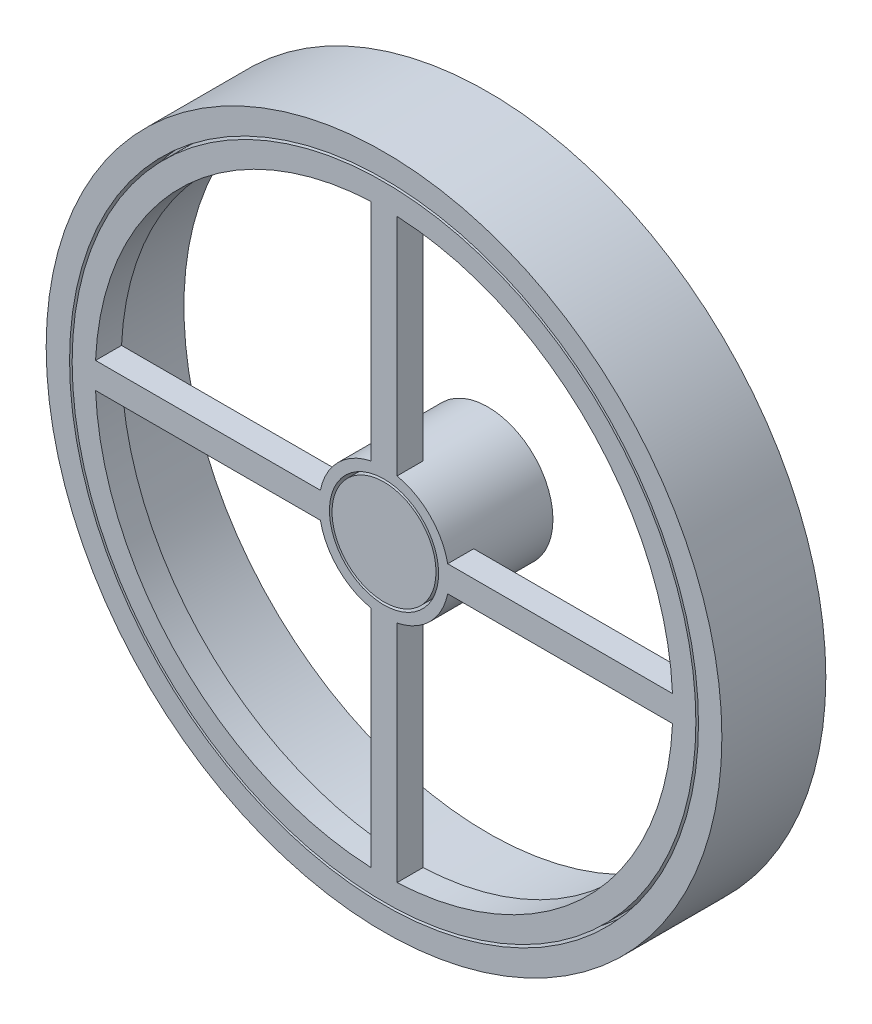
ISO-10303-21;
HEADER;
FILE_DESCRIPTION(('STEP AP214'),'2;1');
FILE_NAME('part.step','',(''),(''),'','','');
FILE_SCHEMA(('AUTOMOTIVE_DESIGN { 1 0 10303 214 1 1 1 1 }'));
ENDSEC;
DATA;
#1=APPLICATION_CONTEXT('core data for automotive mechanical design processes');
#2=APPLICATION_PROTOCOL_DEFINITION('international standard','automotive_design',2000,#1);
#3=PRODUCT_CONTEXT('',#1,'mechanical');
#4=PRODUCT('Part','Part','',(#3));
#5=PRODUCT_RELATED_PRODUCT_CATEGORY('part','',(#4));
#6=PRODUCT_DEFINITION_FORMATION('','',#4);
#7=PRODUCT_DEFINITION_CONTEXT('part definition',#1,'design');
#8=PRODUCT_DEFINITION('design','',#6,#7);
#9=PRODUCT_DEFINITION_SHAPE('','',#8);
#10=(LENGTH_UNIT() NAMED_UNIT(*) SI_UNIT(.MILLI.,.METRE.));
#11=(NAMED_UNIT(*) PLANE_ANGLE_UNIT() SI_UNIT($,.RADIAN.));
#12=(NAMED_UNIT(*) SI_UNIT($,.STERADIAN.) SOLID_ANGLE_UNIT());
#13=UNCERTAINTY_MEASURE_WITH_UNIT(LENGTH_MEASURE(1.E-05),#10,'distance_accuracy_value','');
#14=(GEOMETRIC_REPRESENTATION_CONTEXT(3) GLOBAL_UNCERTAINTY_ASSIGNED_CONTEXT((#13)) GLOBAL_UNIT_ASSIGNED_CONTEXT((#10,
#11,#12)) REPRESENTATION_CONTEXT('',''));
#15=CARTESIAN_POINT('',(0.,0.,0.));
#16=DIRECTION('',(0.,0.,1.));
#17=DIRECTION('',(1.,0.,0.));
#18=AXIS2_PLACEMENT_3D('',#15,#16,#17);
#19=CARTESIAN_POINT('',(0.,0.,15.));
#20=DIRECTION('',(0.,0.,-1.));
#21=DIRECTION('',(-1.,0.,0.));
#22=AXIS2_PLACEMENT_3D('',#19,#20,#21);
#23=PLANE('',#22);
#24=CARTESIAN_POINT('',(0.,0.,15.));
#25=DIRECTION('',(0.,0.,-1.));
#26=DIRECTION('',(-1.,0.,0.));
#27=AXIS2_PLACEMENT_3D('',#24,#25,#26);
#28=CIRCLE('',#27,10.);
#29=CARTESIAN_POINT('',(-10.,0.,15.));
#30=VERTEX_POINT('',#29);
#31=EDGE_CURVE('E299',#30,#30,#28,.T.);
#32=ORIENTED_EDGE('',*,*,#31,.T.);
#33=EDGE_LOOP('',(#32));
#34=FACE_BOUND('',#33,.T.);
#35=CARTESIAN_POINT('',(0.,0.,15.));
#36=DIRECTION('',(0.,0.,-1.));
#37=DIRECTION('',(-1.,0.,0.));
#38=AXIS2_PLACEMENT_3D('',#35,#36,#37);
#39=CIRCLE('',#38,10.5);
#40=CARTESIAN_POINT('',(-10.5,0.,15.));
#41=VERTEX_POINT('',#40);
#42=EDGE_CURVE('E11',#41,#41,#39,.T.);
#43=ORIENTED_EDGE('',*,*,#42,.F.);
#44=EDGE_LOOP('',(#43));
#45=FACE_BOUND('',#44,.T.);
#46=ADVANCED_FACE('F35',(#34,#45),#23,.F.);
#47=CARTESIAN_POINT('',(0.,0.,0.));
#48=DIRECTION('',(0.,0.,1.));
#49=DIRECTION('',(1.,0.,0.));
#50=AXIS2_PLACEMENT_3D('',#47,#48,#49);
#51=CYLINDRICAL_SURFACE('',#50,10.);
#52=CARTESIAN_POINT('',(0.,0.,20.));
#53=DIRECTION('',(0.,0.,1.));
#54=DIRECTION('',(1.,0.,0.));
#55=AXIS2_PLACEMENT_3D('',#52,#53,#54);
#56=CIRCLE('',#55,10.);
#57=CARTESIAN_POINT('',(10.,0.,20.));
#58=VERTEX_POINT('',#57);
#59=EDGE_CURVE('E43',#58,#58,#56,.T.);
#60=ORIENTED_EDGE('',*,*,#59,.F.);
#61=EDGE_LOOP('',(#60));
#62=FACE_BOUND('',#61,.T.);
#63=ORIENTED_EDGE('',*,*,#31,.F.);
#64=EDGE_LOOP('',(#63));
#65=FACE_BOUND('',#64,.T.);
#66=ADVANCED_FACE('F37',(#62,#65),#51,.T.);
#67=CARTESIAN_POINT('',(0.,0.,20.));
#68=DIRECTION('',(0.,0.,1.));
#69=DIRECTION('',(1.,0.,0.));
#70=AXIS2_PLACEMENT_3D('',#67,#68,#69);
#71=PLANE('',#70);
#72=ORIENTED_EDGE('',*,*,#59,.T.);
#73=EDGE_LOOP('',(#72));
#74=FACE_BOUND('',#73,.T.);
#75=ADVANCED_FACE('F342',(#74),#71,.T.);
#76=CARTESIAN_POINT('',(0.,0.,20.));
#77=DIRECTION('',(0.,0.,1.));
#78=DIRECTION('',(1.,0.,0.));
#79=AXIS2_PLACEMENT_3D('',#76,#77,#78);
#80=PLANE('',#79);
#81=DIRECTION('',(0.,1.,0.));
#82=VECTOR('',#81,1.);
#83=CARTESIAN_POINT('',(-2.49999999999999,0.,20.));
#84=LINE('',#83,#82);
#85=CARTESIAN_POINT('',(-2.49999999999999,12.2474487139159,20.));
#86=VERTEX_POINT('',#85);
#87=CARTESIAN_POINT('',(-2.5,55.5,20.));
#88=VERTEX_POINT('',#87);
#89=EDGE_CURVE('E58',#86,#88,#84,.T.);
#90=ORIENTED_EDGE('',*,*,#89,.F.);
#91=CARTESIAN_POINT('',(0.,0.,20.));
#92=DIRECTION('',(0.,0.,1.));
#93=DIRECTION('',(1.,0.,0.));
#94=AXIS2_PLACEMENT_3D('',#91,#92,#93);
#95=CIRCLE('',#94,12.5);
#96=CARTESIAN_POINT('',(-12.2474487139159,2.5,20.));
#97=VERTEX_POINT('',#96);
#98=EDGE_CURVE('E170',#86,#97,#95,.T.);
#99=ORIENTED_EDGE('',*,*,#98,.T.);
#100=DIRECTION('',(-1.,0.,0.));
#101=VECTOR('',#100,1.);
#102=CARTESIAN_POINT('',(0.,2.5,20.));
#103=LINE('',#102,#101);
#104=CARTESIAN_POINT('',(-55.5,2.5,20.));
#105=VERTEX_POINT('',#104);
#106=EDGE_CURVE('E173',#97,#105,#103,.T.);
#107=ORIENTED_EDGE('',*,*,#106,.T.);
#108=CARTESIAN_POINT('',(0.,0.,20.));
#109=DIRECTION('',(0.,0.,1.));
#110=DIRECTION('',(1.,0.,0.));
#111=AXIS2_PLACEMENT_3D('',#108,#109,#110);
#112=CIRCLE('',#111,55.5562777730834);
#113=EDGE_CURVE('E178',#88,#105,#112,.T.);
#114=ORIENTED_EDGE('',*,*,#113,.F.);
#115=EDGE_LOOP('',(#90,#99,#107,#114));
#116=FACE_BOUND('',#115,.T.);
#117=DIRECTION('',(0.,-1.,0.));
#118=VECTOR('',#117,1.);
#119=CARTESIAN_POINT('',(2.50000000000001,0.,20.));
#120=LINE('',#119,#118);
#121=CARTESIAN_POINT('',(2.50000000000001,-12.2474487139159,20.));
#122=VERTEX_POINT('',#121);
#123=CARTESIAN_POINT('',(2.5,-55.5,20.));
#124=VERTEX_POINT('',#123);
#125=EDGE_CURVE('E197',#122,#124,#120,.T.);
#126=ORIENTED_EDGE('',*,*,#125,.F.);
#127=CARTESIAN_POINT('',(0.,0.,20.));
#128=DIRECTION('',(0.,0.,1.));
#129=DIRECTION('',(1.,0.,0.));
#130=AXIS2_PLACEMENT_3D('',#127,#128,#129);
#131=CIRCLE('',#130,12.5);
#132=CARTESIAN_POINT('',(12.2474487139159,-2.5,20.));
#133=VERTEX_POINT('',#132);
#134=EDGE_CURVE('E193',#122,#133,#131,.T.);
#135=ORIENTED_EDGE('',*,*,#134,.T.);
#136=DIRECTION('',(1.,0.,0.));
#137=VECTOR('',#136,1.);
#138=CARTESIAN_POINT('',(0.,-2.5,20.));
#139=LINE('',#138,#137);
#140=CARTESIAN_POINT('',(55.5,-2.5,20.));
#141=VERTEX_POINT('',#140);
#142=EDGE_CURVE('E203',#133,#141,#139,.T.);
#143=ORIENTED_EDGE('',*,*,#142,.T.);
#144=CARTESIAN_POINT('',(0.,0.,20.));
#145=DIRECTION('',(0.,0.,1.));
#146=DIRECTION('',(1.,0.,0.));
#147=AXIS2_PLACEMENT_3D('',#144,#145,#146);
#148=CIRCLE('',#147,55.5562777730834);
#149=EDGE_CURVE('E199',#124,#141,#148,.T.);
#150=ORIENTED_EDGE('',*,*,#149,.F.);
#151=EDGE_LOOP('',(#126,#135,#143,#150));
#152=FACE_BOUND('',#151,.T.);
#153=DIRECTION('',(1.,0.,0.));
#154=VECTOR('',#153,1.);
#155=CARTESIAN_POINT('',(0.,2.5,20.));
#156=LINE('',#155,#154);
#157=CARTESIAN_POINT('',(12.2474487139159,2.5,20.));
#158=VERTEX_POINT('',#157);
#159=CARTESIAN_POINT('',(55.5,2.5,20.));
#160=VERTEX_POINT('',#159);
#161=EDGE_CURVE('E226',#158,#160,#156,.T.);
#162=ORIENTED_EDGE('',*,*,#161,.F.);
#163=CARTESIAN_POINT('',(0.,0.,20.));
#164=DIRECTION('',(0.,0.,1.));
#165=DIRECTION('',(1.,0.,0.));
#166=AXIS2_PLACEMENT_3D('',#163,#164,#165);
#167=CIRCLE('',#166,12.5);
#168=CARTESIAN_POINT('',(2.50000000000001,12.2474487139159,20.));
#169=VERTEX_POINT('',#168);
#170=EDGE_CURVE('E219',#158,#169,#167,.T.);
#171=ORIENTED_EDGE('',*,*,#170,.T.);
#172=DIRECTION('',(0.,1.,0.));
#173=VECTOR('',#172,1.);
#174=CARTESIAN_POINT('',(2.50000000000001,0.,20.));
#175=LINE('',#174,#173);
#176=CARTESIAN_POINT('',(2.5,55.5,20.));
#177=VERTEX_POINT('',#176);
#178=EDGE_CURVE('E232',#169,#177,#175,.T.);
#179=ORIENTED_EDGE('',*,*,#178,.T.);
#180=CARTESIAN_POINT('',(0.,0.,20.));
#181=DIRECTION('',(0.,0.,1.));
#182=DIRECTION('',(1.,0.,0.));
#183=AXIS2_PLACEMENT_3D('',#180,#181,#182);
#184=CIRCLE('',#183,55.5562777730834);
#185=EDGE_CURVE('E228',#160,#177,#184,.T.);
#186=ORIENTED_EDGE('',*,*,#185,.F.);
#187=EDGE_LOOP('',(#162,#171,#179,#186));
#188=FACE_BOUND('',#187,.T.);
#189=CARTESIAN_POINT('',(0.,0.,20.));
#190=DIRECTION('',(0.,0.,1.));
#191=DIRECTION('',(1.,0.,0.));
#192=AXIS2_PLACEMENT_3D('',#189,#190,#191);
#193=CIRCLE('',#192,60.);
#194=CARTESIAN_POINT('',(60.,0.,20.));
#195=VERTEX_POINT('',#194);
#196=EDGE_CURVE('E275',#195,#195,#193,.T.);
#197=ORIENTED_EDGE('',*,*,#196,.T.);
#198=EDGE_LOOP('',(#197));
#199=FACE_BOUND('',#198,.T.);
#200=CARTESIAN_POINT('',(0.,0.,20.));
#201=DIRECTION('',(0.,0.,1.));
#202=DIRECTION('',(1.,0.,0.));
#203=AXIS2_PLACEMENT_3D('',#200,#201,#202);
#204=CIRCLE('',#203,10.5);
#205=CARTESIAN_POINT('',(10.5,0.,20.));
#206=VERTEX_POINT('',#205);
#207=EDGE_CURVE('E185',#206,#206,#204,.T.);
#208=ORIENTED_EDGE('',*,*,#207,.F.);
#209=EDGE_LOOP('',(#208));
#210=FACE_BOUND('',#209,.T.);
#211=DIRECTION('',(-1.,0.,0.));
#212=VECTOR('',#211,1.);
#213=CARTESIAN_POINT('',(0.,-2.5,20.));
#214=LINE('',#213,#212);
#215=CARTESIAN_POINT('',(-12.2474487139159,-2.5,20.));
#216=VERTEX_POINT('',#215);
#217=CARTESIAN_POINT('',(-55.5,-2.5,20.));
#218=VERTEX_POINT('',#217);
#219=EDGE_CURVE('E257',#216,#218,#214,.T.);
#220=ORIENTED_EDGE('',*,*,#219,.F.);
#221=CARTESIAN_POINT('',(0.,0.,20.));
#222=DIRECTION('',(0.,0.,1.));
#223=DIRECTION('',(1.,0.,0.));
#224=AXIS2_PLACEMENT_3D('',#221,#222,#223);
#225=CIRCLE('',#224,12.5);
#226=CARTESIAN_POINT('',(-2.49999999999999,-12.2474487139159,20.));
#227=VERTEX_POINT('',#226);
#228=EDGE_CURVE('E254',#216,#227,#225,.T.);
#229=ORIENTED_EDGE('',*,*,#228,.T.);
#230=DIRECTION('',(0.,-1.,0.));
#231=VECTOR('',#230,1.);
#232=CARTESIAN_POINT('',(-2.49999999999999,0.,20.));
#233=LINE('',#232,#231);
#234=CARTESIAN_POINT('',(-2.5,-55.5,20.));
#235=VERTEX_POINT('',#234);
#236=EDGE_CURVE('E248',#227,#235,#233,.T.);
#237=ORIENTED_EDGE('',*,*,#236,.T.);
#238=CARTESIAN_POINT('',(0.,0.,20.));
#239=DIRECTION('',(0.,0.,1.));
#240=DIRECTION('',(1.,0.,0.));
#241=AXIS2_PLACEMENT_3D('',#238,#239,#240);
#242=CIRCLE('',#241,55.5562777730834);
#243=EDGE_CURVE('E260',#218,#235,#242,.T.);
#244=ORIENTED_EDGE('',*,*,#243,.F.);
#245=EDGE_LOOP('',(#220,#229,#237,#244));
#246=FACE_BOUND('',#245,.T.);
#247=ADVANCED_FACE('F330',(#116,#152,#188,#199,#210,#246),#80,.T.);
#248=CARTESIAN_POINT('',(0.,0.,15.));
#249=DIRECTION('',(0.,0.,1.));
#250=DIRECTION('',(1.,0.,0.));
#251=AXIS2_PLACEMENT_3D('',#248,#249,#250);
#252=PLANE('',#251);
#253=DIRECTION('',(0.,1.,0.));
#254=VECTOR('',#253,1.);
#255=CARTESIAN_POINT('',(2.50000000000001,0.,15.));
#256=LINE('',#255,#254);
#257=CARTESIAN_POINT('',(2.50000000000001,12.2474487139159,15.));
#258=VERTEX_POINT('',#257);
#259=CARTESIAN_POINT('',(2.5,55.5,15.));
#260=VERTEX_POINT('',#259);
#261=EDGE_CURVE('E222',#258,#260,#256,.T.);
#262=ORIENTED_EDGE('',*,*,#261,.F.);
#263=CARTESIAN_POINT('',(0.,0.,15.));
#264=DIRECTION('',(0.,0.,-1.));
#265=DIRECTION('',(-1.,0.,0.));
#266=AXIS2_PLACEMENT_3D('',#263,#264,#265);
#267=CIRCLE('',#266,12.5);
#268=CARTESIAN_POINT('',(-2.49999999999999,12.2474487139159,15.));
#269=VERTEX_POINT('',#268);
#270=EDGE_CURVE('E168',#269,#258,#267,.T.);
#271=ORIENTED_EDGE('',*,*,#270,.F.);
#272=DIRECTION('',(0.,1.,0.));
#273=VECTOR('',#272,1.);
#274=CARTESIAN_POINT('',(-2.49999999999999,0.,15.));
#275=LINE('',#274,#273);
#276=CARTESIAN_POINT('',(-2.5,55.5,15.));
#277=VERTEX_POINT('',#276);
#278=EDGE_CURVE('E151',#269,#277,#275,.T.);
#279=ORIENTED_EDGE('',*,*,#278,.T.);
#280=CARTESIAN_POINT('',(0.,0.,15.));
#281=DIRECTION('',(0.,0.,1.));
#282=DIRECTION('',(1.,0.,0.));
#283=AXIS2_PLACEMENT_3D('',#280,#281,#282);
#284=CIRCLE('',#283,55.5562777730834);
#285=CARTESIAN_POINT('',(-55.5,2.5,15.));
#286=VERTEX_POINT('',#285);
#287=EDGE_CURVE('E159',#277,#286,#284,.T.);
#288=ORIENTED_EDGE('',*,*,#287,.T.);
#289=DIRECTION('',(-1.,0.,0.));
#290=VECTOR('',#289,1.);
#291=CARTESIAN_POINT('',(0.,2.5,15.));
#292=LINE('',#291,#290);
#293=CARTESIAN_POINT('',(-12.2474487139159,2.5,15.));
#294=VERTEX_POINT('',#293);
#295=EDGE_CURVE('E156',#294,#286,#292,.T.);
#296=ORIENTED_EDGE('',*,*,#295,.F.);
#297=CARTESIAN_POINT('',(-12.2474487139159,-2.5,15.));
#298=VERTEX_POINT('',#297);
#299=EDGE_CURVE('E300',#298,#294,#267,.T.);
#300=ORIENTED_EDGE('',*,*,#299,.F.);
#301=DIRECTION('',(-1.,0.,0.));
#302=VECTOR('',#301,1.);
#303=CARTESIAN_POINT('',(0.,-2.5,15.));
#304=LINE('',#303,#302);
#305=CARTESIAN_POINT('',(-55.5,-2.5,15.));
#306=VERTEX_POINT('',#305);
#307=EDGE_CURVE('E244',#298,#306,#304,.T.);
#308=ORIENTED_EDGE('',*,*,#307,.T.);
#309=CARTESIAN_POINT('',(0.,0.,15.));
#310=DIRECTION('',(0.,0.,1.));
#311=DIRECTION('',(1.,0.,0.));
#312=AXIS2_PLACEMENT_3D('',#309,#310,#311);
#313=CIRCLE('',#312,55.5562777730834);
#314=CARTESIAN_POINT('',(-2.5,-55.5,15.));
#315=VERTEX_POINT('',#314);
#316=EDGE_CURVE('E247',#306,#315,#313,.T.);
#317=ORIENTED_EDGE('',*,*,#316,.T.);
#318=DIRECTION('',(0.,-1.,0.));
#319=VECTOR('',#318,1.);
#320=CARTESIAN_POINT('',(-2.49999999999999,0.,15.));
#321=LINE('',#320,#319);
#322=CARTESIAN_POINT('',(-2.49999999999999,-12.2474487139159,15.));
#323=VERTEX_POINT('',#322);
#324=EDGE_CURVE('E251',#323,#315,#321,.T.);
#325=ORIENTED_EDGE('',*,*,#324,.F.);
#326=CARTESIAN_POINT('',(2.50000000000001,-12.2474487139159,15.));
#327=VERTEX_POINT('',#326);
#328=EDGE_CURVE('E303',#327,#323,#267,.T.);
#329=ORIENTED_EDGE('',*,*,#328,.F.);
#330=DIRECTION('',(0.,-1.,0.));
#331=VECTOR('',#330,1.);
#332=CARTESIAN_POINT('',(2.50000000000001,0.,15.));
#333=LINE('',#332,#331);
#334=CARTESIAN_POINT('',(2.5,-55.5,15.));
#335=VERTEX_POINT('',#334);
#336=EDGE_CURVE('E189',#327,#335,#333,.T.);
#337=ORIENTED_EDGE('',*,*,#336,.T.);
#338=CARTESIAN_POINT('',(0.,0.,15.));
#339=DIRECTION('',(0.,0.,1.));
#340=DIRECTION('',(1.,0.,0.));
#341=AXIS2_PLACEMENT_3D('',#338,#339,#340);
#342=CIRCLE('',#341,55.5562777730834);
#343=CARTESIAN_POINT('',(55.5,-2.5,15.));
#344=VERTEX_POINT('',#343);
#345=EDGE_CURVE('E192',#335,#344,#342,.T.);
#346=ORIENTED_EDGE('',*,*,#345,.T.);
#347=DIRECTION('',(1.,0.,0.));
#348=VECTOR('',#347,1.);
#349=CARTESIAN_POINT('',(0.,-2.5,15.));
#350=LINE('',#349,#348);
#351=CARTESIAN_POINT('',(12.2474487139159,-2.5,15.));
#352=VERTEX_POINT('',#351);
#353=EDGE_CURVE('E50',#352,#344,#350,.T.);
#354=ORIENTED_EDGE('',*,*,#353,.F.);
#355=CARTESIAN_POINT('',(12.2474487139159,2.5,15.));
#356=VERTEX_POINT('',#355);
#357=EDGE_CURVE('E311',#356,#352,#267,.T.);
#358=ORIENTED_EDGE('',*,*,#357,.F.);
#359=DIRECTION('',(1.,0.,0.));
#360=VECTOR('',#359,1.);
#361=CARTESIAN_POINT('',(0.,2.5,15.));
#362=LINE('',#361,#360);
#363=CARTESIAN_POINT('',(55.5,2.5,15.));
#364=VERTEX_POINT('',#363);
#365=EDGE_CURVE('E215',#356,#364,#362,.T.);
#366=ORIENTED_EDGE('',*,*,#365,.T.);
#367=CARTESIAN_POINT('',(0.,0.,15.));
#368=DIRECTION('',(0.,0.,1.));
#369=DIRECTION('',(1.,0.,0.));
#370=AXIS2_PLACEMENT_3D('',#367,#368,#369);
#371=CIRCLE('',#370,55.5562777730834);
#372=EDGE_CURVE('E218',#364,#260,#371,.T.);
#373=ORIENTED_EDGE('',*,*,#372,.T.);
#374=EDGE_LOOP('',(#262,#271,#279,#288,#296,#300,#308,#317,#325,#329,#337,#346,#354,#358,#366,#373));
#375=FACE_BOUND('',#374,.T.);
#376=CARTESIAN_POINT('',(0.,0.,15.));
#377=DIRECTION('',(0.,0.,1.));
#378=DIRECTION('',(1.,0.,0.));
#379=AXIS2_PLACEMENT_3D('',#376,#377,#378);
#380=CIRCLE('',#379,58.5);
#381=CARTESIAN_POINT('',(58.5,0.,15.));
#382=VERTEX_POINT('',#381);
#383=EDGE_CURVE('E294',#382,#382,#380,.F.);
#384=ORIENTED_EDGE('',*,*,#383,.T.);
#385=EDGE_LOOP('',(#384));
#386=FACE_BOUND('',#385,.T.);
#387=ADVANCED_FACE('F165',(#375,#386),#252,.F.);
#388=CARTESIAN_POINT('',(0.,0.,0.));
#389=DIRECTION('',(0.,0.,1.));
#390=DIRECTION('',(1.,0.,0.));
#391=AXIS2_PLACEMENT_3D('',#388,#389,#390);
#392=CYLINDRICAL_SURFACE('',#391,58.5);
#393=CARTESIAN_POINT('',(0.,0.,0.));
#394=DIRECTION('',(0.,0.,1.));
#395=DIRECTION('',(1.,0.,0.));
#396=AXIS2_PLACEMENT_3D('',#393,#394,#395);
#397=CIRCLE('',#396,58.5);
#398=CARTESIAN_POINT('',(58.5,0.,0.));
#399=VERTEX_POINT('',#398);
#400=EDGE_CURVE('E285',#399,#399,#397,.T.);
#401=ORIENTED_EDGE('',*,*,#400,.F.);
#402=EDGE_LOOP('',(#401));
#403=FACE_BOUND('',#402,.T.);
#404=ORIENTED_EDGE('',*,*,#383,.F.);
#405=EDGE_LOOP('',(#404));
#406=FACE_BOUND('',#405,.T.);
#407=ADVANCED_FACE('F403',(#403,#406),#392,.F.);
#408=CARTESIAN_POINT('',(0.,0.,20.));
#409=DIRECTION('',(0.,0.,-1.));
#410=DIRECTION('',(-1.,0.,0.));
#411=AXIS2_PLACEMENT_3D('',#408,#409,#410);
#412=CYLINDRICAL_SURFACE('',#411,65.);
#413=CARTESIAN_POINT('',(0.,0.,20.));
#414=DIRECTION('',(0.,0.,1.));
#415=DIRECTION('',(1.,0.,0.));
#416=AXIS2_PLACEMENT_3D('',#413,#414,#415);
#417=CIRCLE('',#416,65.);
#418=CARTESIAN_POINT('',(65.,0.,20.));
#419=VERTEX_POINT('',#418);
#420=EDGE_CURVE('E291',#419,#419,#417,.T.);
#421=ORIENTED_EDGE('',*,*,#420,.F.);
#422=EDGE_LOOP('',(#421));
#423=FACE_BOUND('',#422,.T.);
#424=CARTESIAN_POINT('',(0.,0.,0.));
#425=DIRECTION('',(0.,0.,1.));
#426=DIRECTION('',(1.,0.,0.));
#427=AXIS2_PLACEMENT_3D('',#424,#425,#426);
#428=CIRCLE('',#427,65.);
#429=CARTESIAN_POINT('',(65.,0.,0.));
#430=VERTEX_POINT('',#429);
#431=EDGE_CURVE('E290',#430,#430,#428,.T.);
#432=ORIENTED_EDGE('',*,*,#431,.T.);
#433=EDGE_LOOP('',(#432));
#434=FACE_BOUND('',#433,.T.);
#435=ADVANCED_FACE('F380',(#423,#434),#412,.T.);
#436=CARTESIAN_POINT('',(0.,0.,20.));
#437=DIRECTION('',(0.,0.,1.));
#438=DIRECTION('',(1.,0.,0.));
#439=AXIS2_PLACEMENT_3D('',#436,#437,#438);
#440=CIRCLE('',#439,60.5);
#441=CARTESIAN_POINT('',(60.5,0.,20.));
#442=VERTEX_POINT('',#441);
#443=EDGE_CURVE('E279',#442,#442,#440,.T.);
#444=ORIENTED_EDGE('',*,*,#443,.F.);
#445=EDGE_LOOP('',(#444));
#446=FACE_BOUND('',#445,.T.);
#447=ORIENTED_EDGE('',*,*,#420,.T.);
#448=EDGE_LOOP('',(#447));
#449=FACE_BOUND('',#448,.T.);
#450=ADVANCED_FACE('F344',(#446,#449),#80,.T.);
#451=CARTESIAN_POINT('',(0.,0.,0.));
#452=DIRECTION('',(0.,0.,1.));
#453=DIRECTION('',(1.,0.,0.));
#454=AXIS2_PLACEMENT_3D('',#451,#452,#453);
#455=PLANE('',#454);
#456=ORIENTED_EDGE('',*,*,#400,.T.);
#457=EDGE_LOOP('',(#456));
#458=FACE_BOUND('',#457,.T.);
#459=ORIENTED_EDGE('',*,*,#431,.F.);
#460=EDGE_LOOP('',(#459));
#461=FACE_BOUND('',#460,.T.);
#462=ADVANCED_FACE('F422',(#458,#461),#455,.F.);
#463=CARTESIAN_POINT('',(0.,0.,15.));
#464=DIRECTION('',(0.,0.,1.));
#465=DIRECTION('',(1.,0.,0.));
#466=AXIS2_PLACEMENT_3D('',#463,#464,#465);
#467=CYLINDRICAL_SURFACE('',#466,60.5);
#468=CARTESIAN_POINT('',(0.,0.,15.));
#469=DIRECTION('',(0.,0.,1.));
#470=DIRECTION('',(1.,0.,0.));
#471=AXIS2_PLACEMENT_3D('',#468,#469,#470);
#472=CIRCLE('',#471,60.5);
#473=CARTESIAN_POINT('',(60.5,0.,15.));
#474=VERTEX_POINT('',#473);
#475=EDGE_CURVE('E282',#474,#474,#472,.T.);
#476=ORIENTED_EDGE('',*,*,#475,.F.);
#477=EDGE_LOOP('',(#476));
#478=FACE_BOUND('',#477,.T.);
#479=ORIENTED_EDGE('',*,*,#443,.T.);
#480=EDGE_LOOP('',(#479));
#481=FACE_BOUND('',#480,.T.);
#482=ADVANCED_FACE('F429',(#478,#481),#467,.F.);
#483=CARTESIAN_POINT('',(0.,0.,15.));
#484=DIRECTION('',(0.,0.,1.));
#485=DIRECTION('',(1.,0.,0.));
#486=AXIS2_PLACEMENT_3D('',#483,#484,#485);
#487=PLANE('',#486);
#488=CARTESIAN_POINT('',(0.,0.,15.));
#489=DIRECTION('',(0.,0.,1.));
#490=DIRECTION('',(1.,0.,0.));
#491=AXIS2_PLACEMENT_3D('',#488,#489,#490);
#492=CIRCLE('',#491,60.);
#493=CARTESIAN_POINT('',(60.,0.,15.));
#494=VERTEX_POINT('',#493);
#495=EDGE_CURVE('E276',#494,#494,#492,.T.);
#496=ORIENTED_EDGE('',*,*,#495,.F.);
#497=EDGE_LOOP('',(#496));
#498=FACE_BOUND('',#497,.T.);
#499=ORIENTED_EDGE('',*,*,#475,.T.);
#500=EDGE_LOOP('',(#499));
#501=FACE_BOUND('',#500,.T.);
#502=ADVANCED_FACE('F365',(#498,#501),#487,.T.);
#503=CARTESIAN_POINT('',(0.,0.,15.));
#504=DIRECTION('',(0.,0.,1.));
#505=DIRECTION('',(1.,0.,0.));
#506=AXIS2_PLACEMENT_3D('',#503,#504,#505);
#507=CYLINDRICAL_SURFACE('',#506,60.);
#508=ORIENTED_EDGE('',*,*,#495,.T.);
#509=EDGE_LOOP('',(#508));
#510=FACE_BOUND('',#509,.T.);
#511=ORIENTED_EDGE('',*,*,#196,.F.);
#512=EDGE_LOOP('',(#511));
#513=FACE_BOUND('',#512,.T.);
#514=ADVANCED_FACE('F357',(#510,#513),#507,.T.);
#515=CARTESIAN_POINT('',(0.,0.,15.));
#516=DIRECTION('',(0.,0.,1.));
#517=DIRECTION('',(1.,0.,0.));
#518=AXIS2_PLACEMENT_3D('',#515,#516,#517);
#519=CYLINDRICAL_SURFACE('',#518,10.5);
#520=ORIENTED_EDGE('',*,*,#42,.T.);
#521=EDGE_LOOP('',(#520));
#522=FACE_BOUND('',#521,.T.);
#523=ORIENTED_EDGE('',*,*,#207,.T.);
#524=EDGE_LOOP('',(#523));
#525=FACE_BOUND('',#524,.T.);
#526=ADVANCED_FACE('F355',(#522,#525),#519,.F.);
#527=CARTESIAN_POINT('',(-2.49999999999999,0.,15.));
#528=DIRECTION('',(-1.,0.,0.));
#529=DIRECTION('',(0.,-1.,0.));
#530=AXIS2_PLACEMENT_3D('',#527,#528,#529);
#531=PLANE('',#530);
#532=ORIENTED_EDGE('',*,*,#236,.F.);
#533=DIRECTION('',(0.,0.,1.));
#534=VECTOR('',#533,1.);
#535=CARTESIAN_POINT('',(-2.49999999999999,-12.2474487139159,15.));
#536=LINE('',#535,#534);
#537=EDGE_CURVE('E229',#323,#227,#536,.T.);
#538=ORIENTED_EDGE('',*,*,#537,.F.);
#539=ORIENTED_EDGE('',*,*,#324,.T.);
#540=DIRECTION('',(0.,0.,1.));
#541=VECTOR('',#540,1.);
#542=CARTESIAN_POINT('',(-2.5,-55.5,15.));
#543=LINE('',#542,#541);
#544=EDGE_CURVE('E267',#315,#235,#543,.T.);
#545=ORIENTED_EDGE('',*,*,#544,.T.);
#546=EDGE_LOOP('',(#532,#538,#539,#545));
#547=FACE_BOUND('',#546,.T.);
#548=ADVANCED_FACE('F323',(#547),#531,.T.);
#549=CARTESIAN_POINT('',(0.,0.,15.));
#550=DIRECTION('',(0.,0.,1.));
#551=DIRECTION('',(1.,0.,0.));
#552=AXIS2_PLACEMENT_3D('',#549,#550,#551);
#553=CYLINDRICAL_SURFACE('',#552,55.5562777730834);
#554=ORIENTED_EDGE('',*,*,#243,.T.);
#555=ORIENTED_EDGE('',*,*,#544,.F.);
#556=ORIENTED_EDGE('',*,*,#316,.F.);
#557=DIRECTION('',(0.,0.,1.));
#558=VECTOR('',#557,1.);
#559=CARTESIAN_POINT('',(-55.5,-2.5,15.));
#560=LINE('',#559,#558);
#561=EDGE_CURVE('E269',#306,#218,#560,.T.);
#562=ORIENTED_EDGE('',*,*,#561,.T.);
#563=EDGE_LOOP('',(#554,#555,#556,#562));
#564=FACE_BOUND('',#563,.T.);
#565=ADVANCED_FACE('F325',(#564),#553,.F.);
#566=CARTESIAN_POINT('',(0.,-2.5,15.));
#567=DIRECTION('',(0.,1.,0.));
#568=DIRECTION('',(0.,0.,1.));
#569=AXIS2_PLACEMENT_3D('',#566,#567,#568);
#570=PLANE('',#569);
#571=ORIENTED_EDGE('',*,*,#219,.T.);
#572=ORIENTED_EDGE('',*,*,#561,.F.);
#573=ORIENTED_EDGE('',*,*,#307,.F.);
#574=DIRECTION('',(0.,0.,1.));
#575=VECTOR('',#574,1.);
#576=CARTESIAN_POINT('',(-12.2474487139159,-2.5,15.));
#577=LINE('',#576,#575);
#578=EDGE_CURVE('E253',#298,#216,#577,.T.);
#579=ORIENTED_EDGE('',*,*,#578,.T.);
#580=EDGE_LOOP('',(#571,#572,#573,#579));
#581=FACE_BOUND('',#580,.T.);
#582=ADVANCED_FACE('F334',(#581),#570,.F.);
#583=CARTESIAN_POINT('',(0.,2.5,15.));
#584=DIRECTION('',(0.,-1.,0.));
#585=DIRECTION('',(0.,0.,-1.));
#586=AXIS2_PLACEMENT_3D('',#583,#584,#585);
#587=PLANE('',#586);
#588=ORIENTED_EDGE('',*,*,#161,.T.);
#589=DIRECTION('',(0.,0.,1.));
#590=VECTOR('',#589,1.);
#591=CARTESIAN_POINT('',(55.5,2.5,15.));
#592=LINE('',#591,#590);
#593=EDGE_CURVE('E225',#364,#160,#592,.T.);
#594=ORIENTED_EDGE('',*,*,#593,.F.);
#595=ORIENTED_EDGE('',*,*,#365,.F.);
#596=DIRECTION('',(0.,0.,1.));
#597=VECTOR('',#596,1.);
#598=CARTESIAN_POINT('',(12.2474487139159,2.5,15.));
#599=LINE('',#598,#597);
#600=EDGE_CURVE('E200',#356,#158,#599,.T.);
#601=ORIENTED_EDGE('',*,*,#600,.T.);
#602=EDGE_LOOP('',(#588,#594,#595,#601));
#603=FACE_BOUND('',#602,.T.);
#604=ADVANCED_FACE('F475',(#603),#587,.F.);
#605=CARTESIAN_POINT('',(2.50000000000001,0.,15.));
#606=DIRECTION('',(1.,0.,0.));
#607=DIRECTION('',(0.,1.,0.));
#608=AXIS2_PLACEMENT_3D('',#605,#606,#607);
#609=PLANE('',#608);
#610=ORIENTED_EDGE('',*,*,#178,.F.);
#611=DIRECTION('',(0.,0.,1.));
#612=VECTOR('',#611,1.);
#613=CARTESIAN_POINT('',(2.50000000000001,12.2474487139159,15.));
#614=LINE('',#613,#612);
#615=EDGE_CURVE('E238',#258,#169,#614,.T.);
#616=ORIENTED_EDGE('',*,*,#615,.F.);
#617=ORIENTED_EDGE('',*,*,#261,.T.);
#618=DIRECTION('',(0.,0.,1.));
#619=VECTOR('',#618,1.);
#620=CARTESIAN_POINT('',(2.5,55.5,15.));
#621=LINE('',#620,#619);
#622=EDGE_CURVE('E240',#260,#177,#621,.T.);
#623=ORIENTED_EDGE('',*,*,#622,.T.);
#624=EDGE_LOOP('',(#610,#616,#617,#623));
#625=FACE_BOUND('',#624,.T.);
#626=ADVANCED_FACE('F483',(#625),#609,.T.);
#627=CARTESIAN_POINT('',(0.,0.,15.));
#628=DIRECTION('',(0.,0.,1.));
#629=DIRECTION('',(1.,0.,0.));
#630=AXIS2_PLACEMENT_3D('',#627,#628,#629);
#631=CYLINDRICAL_SURFACE('',#630,55.5562777730834);
#632=ORIENTED_EDGE('',*,*,#185,.T.);
#633=ORIENTED_EDGE('',*,*,#622,.F.);
#634=ORIENTED_EDGE('',*,*,#372,.F.);
#635=ORIENTED_EDGE('',*,*,#593,.T.);
#636=EDGE_LOOP('',(#632,#633,#634,#635));
#637=FACE_BOUND('',#636,.T.);
#638=ADVANCED_FACE('F494',(#637),#631,.F.);
#639=CARTESIAN_POINT('',(2.50000000000001,0.,15.));
#640=DIRECTION('',(-1.,0.,0.));
#641=DIRECTION('',(0.,-1.,0.));
#642=AXIS2_PLACEMENT_3D('',#639,#640,#641);
#643=PLANE('',#642);
#644=ORIENTED_EDGE('',*,*,#125,.T.);
#645=DIRECTION('',(0.,0.,1.));
#646=VECTOR('',#645,1.);
#647=CARTESIAN_POINT('',(2.5,-55.5,15.));
#648=LINE('',#647,#646);
#649=EDGE_CURVE('E196',#335,#124,#648,.T.);
#650=ORIENTED_EDGE('',*,*,#649,.F.);
#651=ORIENTED_EDGE('',*,*,#336,.F.);
#652=DIRECTION('',(0.,0.,1.));
#653=VECTOR('',#652,1.);
#654=CARTESIAN_POINT('',(2.50000000000001,-12.2474487139159,15.));
#655=LINE('',#654,#653);
#656=EDGE_CURVE('E179',#327,#122,#655,.T.);
#657=ORIENTED_EDGE('',*,*,#656,.T.);
#658=EDGE_LOOP('',(#644,#650,#651,#657));
#659=FACE_BOUND('',#658,.T.);
#660=ADVANCED_FACE('F505',(#659),#643,.F.);
#661=CARTESIAN_POINT('',(0.,-2.5,15.));
#662=DIRECTION('',(0.,-1.,0.));
#663=DIRECTION('',(0.,0.,-1.));
#664=AXIS2_PLACEMENT_3D('',#661,#662,#663);
#665=PLANE('',#664);
#666=ORIENTED_EDGE('',*,*,#142,.F.);
#667=DIRECTION('',(0.,0.,1.));
#668=VECTOR('',#667,1.);
#669=CARTESIAN_POINT('',(12.2474487139159,-2.5,15.));
#670=LINE('',#669,#668);
#671=EDGE_CURVE('E209',#352,#133,#670,.T.);
#672=ORIENTED_EDGE('',*,*,#671,.F.);
#673=ORIENTED_EDGE('',*,*,#353,.T.);
#674=DIRECTION('',(0.,0.,1.));
#675=VECTOR('',#674,1.);
#676=CARTESIAN_POINT('',(55.5,-2.5,15.));
#677=LINE('',#676,#675);
#678=EDGE_CURVE('E211',#344,#141,#677,.T.);
#679=ORIENTED_EDGE('',*,*,#678,.T.);
#680=EDGE_LOOP('',(#666,#672,#673,#679));
#681=FACE_BOUND('',#680,.T.);
#682=ADVANCED_FACE('F515',(#681),#665,.T.);
#683=CARTESIAN_POINT('',(0.,0.,15.));
#684=DIRECTION('',(0.,0.,1.));
#685=DIRECTION('',(1.,0.,0.));
#686=AXIS2_PLACEMENT_3D('',#683,#684,#685);
#687=CYLINDRICAL_SURFACE('',#686,55.5562777730834);
#688=ORIENTED_EDGE('',*,*,#149,.T.);
#689=ORIENTED_EDGE('',*,*,#678,.F.);
#690=ORIENTED_EDGE('',*,*,#345,.F.);
#691=ORIENTED_EDGE('',*,*,#649,.T.);
#692=EDGE_LOOP('',(#688,#689,#690,#691));
#693=FACE_BOUND('',#692,.T.);
#694=ADVANCED_FACE('F525',(#693),#687,.F.);
#695=CARTESIAN_POINT('',(-2.49999999999999,0.,15.));
#696=DIRECTION('',(1.,0.,0.));
#697=DIRECTION('',(0.,1.,0.));
#698=AXIS2_PLACEMENT_3D('',#695,#696,#697);
#699=PLANE('',#698);
#700=ORIENTED_EDGE('',*,*,#89,.T.);
#701=DIRECTION('',(0.,0.,1.));
#702=VECTOR('',#701,1.);
#703=CARTESIAN_POINT('',(-2.5,55.5,15.));
#704=LINE('',#703,#702);
#705=EDGE_CURVE('E147',#277,#88,#704,.T.);
#706=ORIENTED_EDGE('',*,*,#705,.F.);
#707=ORIENTED_EDGE('',*,*,#278,.F.);
#708=DIRECTION('',(0.,0.,1.));
#709=VECTOR('',#708,1.);
#710=CARTESIAN_POINT('',(-2.49999999999999,12.2474487139159,15.));
#711=LINE('',#710,#709);
#712=EDGE_CURVE('E183',#269,#86,#711,.T.);
#713=ORIENTED_EDGE('',*,*,#712,.T.);
#714=EDGE_LOOP('',(#700,#706,#707,#713));
#715=FACE_BOUND('',#714,.T.);
#716=ADVANCED_FACE('F149',(#715),#699,.F.);
#717=CARTESIAN_POINT('',(0.,2.5,15.));
#718=DIRECTION('',(0.,1.,0.));
#719=DIRECTION('',(0.,0.,1.));
#720=AXIS2_PLACEMENT_3D('',#717,#718,#719);
#721=PLANE('',#720);
#722=ORIENTED_EDGE('',*,*,#106,.F.);
#723=DIRECTION('',(0.,0.,1.));
#724=VECTOR('',#723,1.);
#725=CARTESIAN_POINT('',(-12.2474487139159,2.5,15.));
#726=LINE('',#725,#724);
#727=EDGE_CURVE('E186',#294,#97,#726,.T.);
#728=ORIENTED_EDGE('',*,*,#727,.F.);
#729=ORIENTED_EDGE('',*,*,#295,.T.);
#730=DIRECTION('',(0.,0.,1.));
#731=VECTOR('',#730,1.);
#732=CARTESIAN_POINT('',(-55.5,2.5,15.));
#733=LINE('',#732,#731);
#734=EDGE_CURVE('E155',#286,#105,#733,.T.);
#735=ORIENTED_EDGE('',*,*,#734,.T.);
#736=EDGE_LOOP('',(#722,#728,#729,#735));
#737=FACE_BOUND('',#736,.T.);
#738=ADVANCED_FACE('F338',(#737),#721,.T.);
#739=CARTESIAN_POINT('',(0.,0.,15.));
#740=DIRECTION('',(0.,0.,1.));
#741=DIRECTION('',(1.,0.,0.));
#742=AXIS2_PLACEMENT_3D('',#739,#740,#741);
#743=CYLINDRICAL_SURFACE('',#742,55.5562777730834);
#744=ORIENTED_EDGE('',*,*,#113,.T.);
#745=ORIENTED_EDGE('',*,*,#734,.F.);
#746=ORIENTED_EDGE('',*,*,#287,.F.);
#747=ORIENTED_EDGE('',*,*,#705,.T.);
#748=EDGE_LOOP('',(#744,#745,#746,#747));
#749=FACE_BOUND('',#748,.T.);
#750=ADVANCED_FACE('F160',(#749),#743,.F.);
#751=CARTESIAN_POINT('',(0.,0.,0.));
#752=DIRECTION('',(0.,0.,1.));
#753=DIRECTION('',(1.,0.,0.));
#754=AXIS2_PLACEMENT_3D('',#751,#752,#753);
#755=PLANE('',#754);
#756=CARTESIAN_POINT('',(0.,0.,0.));
#757=DIRECTION('',(0.,0.,1.));
#758=DIRECTION('',(1.,0.,0.));
#759=AXIS2_PLACEMENT_3D('',#756,#757,#758);
#760=CIRCLE('',#759,12.5);
#761=CARTESIAN_POINT('',(12.5,0.,0.));
#762=VERTEX_POINT('',#761);
#763=EDGE_CURVE('E304',#762,#762,#760,.T.);
#764=ORIENTED_EDGE('',*,*,#763,.F.);
#765=EDGE_LOOP('',(#764));
#766=FACE_BOUND('',#765,.T.);
#767=ADVANCED_FACE('F384',(#766),#755,.F.);
#768=CARTESIAN_POINT('',(0.,0.,-35.3553390593274));
#769=DIRECTION('',(0.,0.,1.));
#770=DIRECTION('',(1.,0.,0.));
#771=AXIS2_PLACEMENT_3D('',#768,#769,#770);
#772=CYLINDRICAL_SURFACE('',#771,12.5);
#773=ORIENTED_EDGE('',*,*,#763,.T.);
#774=EDGE_LOOP('',(#773));
#775=FACE_BOUND('',#774,.T.);
#776=ORIENTED_EDGE('',*,*,#299,.T.);
#777=ORIENTED_EDGE('',*,*,#727,.T.);
#778=ORIENTED_EDGE('',*,*,#98,.F.);
#779=ORIENTED_EDGE('',*,*,#712,.F.);
#780=ORIENTED_EDGE('',*,*,#270,.T.);
#781=ORIENTED_EDGE('',*,*,#615,.T.);
#782=ORIENTED_EDGE('',*,*,#170,.F.);
#783=ORIENTED_EDGE('',*,*,#600,.F.);
#784=ORIENTED_EDGE('',*,*,#357,.T.);
#785=ORIENTED_EDGE('',*,*,#671,.T.);
#786=ORIENTED_EDGE('',*,*,#134,.F.);
#787=ORIENTED_EDGE('',*,*,#656,.F.);
#788=ORIENTED_EDGE('',*,*,#328,.T.);
#789=ORIENTED_EDGE('',*,*,#537,.T.);
#790=ORIENTED_EDGE('',*,*,#228,.F.);
#791=ORIENTED_EDGE('',*,*,#578,.F.);
#792=EDGE_LOOP('',(#776,#777,#778,#779,#780,#781,#782,#783,#784,#785,#786,#787,#788,#789,#790,#791));
#793=FACE_BOUND('',#792,.T.);
#794=ADVANCED_FACE('F317',(#775,#793),#772,.T.);
#795=CLOSED_SHELL('',(#46,#66,#75,#247,#387,#407,#435,#450,#462,#482,#502,#514,#526,#548,#565,
#582,#604,#626,#638,#660,#682,#694,#716,#738,#750,#767,#794));
#796=MANIFOLD_SOLID_BREP('B2',#795);
#797=ADVANCED_BREP_SHAPE_REPRESENTATION('',(#18,#796),#14);
#798=SHAPE_DEFINITION_REPRESENTATION(#9,#797);
ENDSEC;
END-ISO-10303-21;
